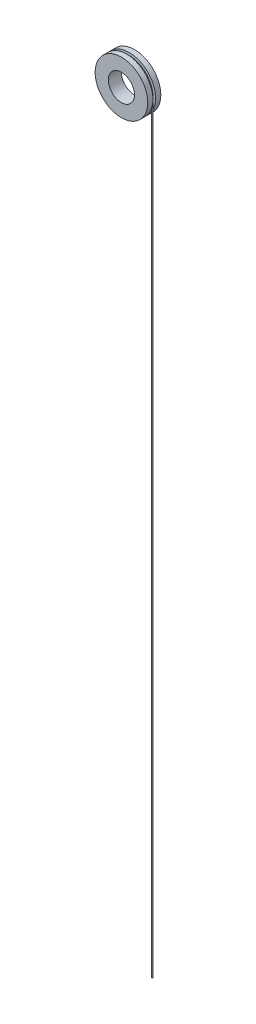
ISO-10303-21;
HEADER;
FILE_DESCRIPTION(('STEP AP214'),'2;1');
FILE_NAME('part.step','',(''),(''),'','','');
FILE_SCHEMA(('AUTOMOTIVE_DESIGN { 1 0 10303 214 1 1 1 1 }'));
ENDSEC;
DATA;
#1=APPLICATION_CONTEXT('core data for automotive mechanical design processes');
#2=APPLICATION_PROTOCOL_DEFINITION('international standard','automotive_design',2000,#1);
#3=PRODUCT_CONTEXT('',#1,'mechanical');
#4=PRODUCT('Part','Part','',(#3));
#5=PRODUCT_RELATED_PRODUCT_CATEGORY('part','',(#4));
#6=PRODUCT_DEFINITION_FORMATION('','',#4);
#7=PRODUCT_DEFINITION_CONTEXT('part definition',#1,'design');
#8=PRODUCT_DEFINITION('design','',#6,#7);
#9=PRODUCT_DEFINITION_SHAPE('','',#8);
#10=(LENGTH_UNIT() NAMED_UNIT(*) SI_UNIT(.MILLI.,.METRE.));
#11=(NAMED_UNIT(*) PLANE_ANGLE_UNIT() SI_UNIT($,.RADIAN.));
#12=(NAMED_UNIT(*) SI_UNIT($,.STERADIAN.) SOLID_ANGLE_UNIT());
#13=UNCERTAINTY_MEASURE_WITH_UNIT(LENGTH_MEASURE(1.E-05),#10,'distance_accuracy_value','');
#14=(GEOMETRIC_REPRESENTATION_CONTEXT(3) GLOBAL_UNCERTAINTY_ASSIGNED_CONTEXT((#13)) GLOBAL_UNIT_ASSIGNED_CONTEXT((#10,
#11,#12)) REPRESENTATION_CONTEXT('',''));
#15=CARTESIAN_POINT('',(0.,0.,0.));
#16=DIRECTION('',(0.,0.,1.));
#17=DIRECTION('',(1.,0.,0.));
#18=AXIS2_PLACEMENT_3D('',#15,#16,#17);
#19=CARTESIAN_POINT('',(9.25000000000002,-290.,0.));
#20=DIRECTION('',(0.,1.,0.));
#21=DIRECTION('',(-1.,0.,0.));
#22=AXIS2_PLACEMENT_3D('',#19,#20,#21);
#23=CYLINDRICAL_SURFACE('',#22,0.25);
#24=CARTESIAN_POINT('',(9.25000000000002,-290.,0.));
#25=DIRECTION('',(0.,1.,0.));
#26=DIRECTION('',(0.,0.,1.));
#27=AXIS2_PLACEMENT_3D('',#24,#25,#26);
#28=CIRCLE('',#27,0.25);
#29=CARTESIAN_POINT('',(9.25000000000002,-290.,0.25));
#30=VERTEX_POINT('',#29);
#31=EDGE_CURVE('E11',#30,#30,#28,.T.);
#32=ORIENTED_EDGE('',*,*,#31,.T.);
#33=EDGE_LOOP('',(#32));
#34=FACE_BOUND('',#33,.T.);
#35=CARTESIAN_POINT('',(9.25,0.,0.));
#36=DIRECTION('',(0.,1.,0.));
#37=DIRECTION('',(0.,0.,1.));
#38=AXIS2_PLACEMENT_3D('',#35,#36,#37);
#39=CIRCLE('',#38,0.25);
#40=CARTESIAN_POINT('',(9.25,0.,0.25));
#41=VERTEX_POINT('',#40);
#42=EDGE_CURVE('E46',#41,#41,#39,.T.);
#43=ORIENTED_EDGE('',*,*,#42,.F.);
#44=EDGE_LOOP('',(#43));
#45=FACE_BOUND('',#44,.T.);
#46=ADVANCED_FACE('F43',(#34,#45),#23,.T.);
#47=CARTESIAN_POINT('',(9.25000000000002,-290.,0.));
#48=DIRECTION('',(0.,1.,0.));
#49=DIRECTION('',(0.,0.,1.));
#50=AXIS2_PLACEMENT_3D('',#47,#48,#49);
#51=PLANE('',#50);
#52=ORIENTED_EDGE('',*,*,#31,.F.);
#53=EDGE_LOOP('',(#52));
#54=FACE_BOUND('',#53,.T.);
#55=ADVANCED_FACE('F58',(#54),#51,.F.);
#56=CARTESIAN_POINT('',(9.25,0.,0.));
#57=DIRECTION('',(0.,1.,0.));
#58=DIRECTION('',(0.,0.,1.));
#59=AXIS2_PLACEMENT_3D('',#56,#57,#58);
#60=PLANE('',#59);
#61=ORIENTED_EDGE('',*,*,#42,.T.);
#62=EDGE_LOOP('',(#61));
#63=FACE_BOUND('',#62,.T.);
#64=ADVANCED_FACE('F55',(#63),#60,.T.);
#65=CLOSED_SHELL('',(#46,#55,#64));
#66=MANIFOLD_SOLID_BREP('B2',#65);
#67=CARTESIAN_POINT('',(0.,0.,2.5));
#68=DIRECTION('',(0.,0.,-1.));
#69=DIRECTION('',(-1.,0.,0.));
#70=AXIS2_PLACEMENT_3D('',#67,#68,#69);
#71=CYLINDRICAL_SURFACE('',#70,10.);
#72=CARTESIAN_POINT('',(0.,0.,-2.5));
#73=DIRECTION('',(0.,0.,1.));
#74=DIRECTION('',(1.,0.,0.));
#75=AXIS2_PLACEMENT_3D('',#72,#73,#74);
#76=CIRCLE('',#75,10.);
#77=CARTESIAN_POINT('',(10.,0.,-2.5));
#78=VERTEX_POINT('',#77);
#79=EDGE_CURVE('E88',#78,#78,#76,.T.);
#80=ORIENTED_EDGE('',*,*,#79,.T.);
#81=EDGE_LOOP('',(#80));
#82=FACE_BOUND('',#81,.T.);
#83=CARTESIAN_POINT('',(0.,0.,-0.5));
#84=DIRECTION('',(0.,0.,1.));
#85=DIRECTION('',(1.,0.,0.));
#86=AXIS2_PLACEMENT_3D('',#83,#84,#85);
#87=CIRCLE('',#86,10.);
#88=CARTESIAN_POINT('',(10.,0.,-0.5));
#89=VERTEX_POINT('',#88);
#90=EDGE_CURVE('E111',#89,#89,#87,.T.);
#91=ORIENTED_EDGE('',*,*,#90,.F.);
#92=EDGE_LOOP('',(#91));
#93=FACE_BOUND('',#92,.T.);
#94=ADVANCED_FACE('F84',(#82,#93),#71,.T.);
#95=CARTESIAN_POINT('',(0.,0.,2.5));
#96=DIRECTION('',(0.,0.,1.));
#97=DIRECTION('',(1.,0.,0.));
#98=AXIS2_PLACEMENT_3D('',#95,#96,#97);
#99=PLANE('',#98);
#100=CARTESIAN_POINT('',(0.,0.,2.5));
#101=DIRECTION('',(0.,0.,1.));
#102=DIRECTION('',(1.,0.,0.));
#103=AXIS2_PLACEMENT_3D('',#100,#101,#102);
#104=CIRCLE('',#103,10.);
#105=CARTESIAN_POINT('',(10.,0.,2.5));
#106=VERTEX_POINT('',#105);
#107=EDGE_CURVE('E41',#106,#106,#104,.T.);
#108=ORIENTED_EDGE('',*,*,#107,.T.);
#109=EDGE_LOOP('',(#108));
#110=FACE_BOUND('',#109,.T.);
#111=CARTESIAN_POINT('',(0.,0.,2.5));
#112=DIRECTION('',(0.,0.,1.));
#113=DIRECTION('',(1.,0.,0.));
#114=AXIS2_PLACEMENT_3D('',#111,#112,#113);
#115=CIRCLE('',#114,5.);
#116=CARTESIAN_POINT('',(5.,0.,2.5));
#117=VERTEX_POINT('',#116);
#118=EDGE_CURVE('E117',#117,#117,#115,.T.);
#119=ORIENTED_EDGE('',*,*,#118,.F.);
#120=EDGE_LOOP('',(#119));
#121=FACE_BOUND('',#120,.T.);
#122=ADVANCED_FACE('F140',(#110,#121),#99,.T.);
#123=CARTESIAN_POINT('',(0.,0.,-2.5));
#124=DIRECTION('',(0.,0.,1.));
#125=DIRECTION('',(1.,0.,0.));
#126=AXIS2_PLACEMENT_3D('',#123,#124,#125);
#127=PLANE('',#126);
#128=ORIENTED_EDGE('',*,*,#79,.F.);
#129=EDGE_LOOP('',(#128));
#130=FACE_BOUND('',#129,.T.);
#131=CARTESIAN_POINT('',(0.,0.,-2.5));
#132=DIRECTION('',(0.,0.,1.));
#133=DIRECTION('',(1.,0.,0.));
#134=AXIS2_PLACEMENT_3D('',#131,#132,#133);
#135=CIRCLE('',#134,5.);
#136=CARTESIAN_POINT('',(5.,0.,-2.5));
#137=VERTEX_POINT('',#136);
#138=EDGE_CURVE('E114',#137,#137,#135,.T.);
#139=ORIENTED_EDGE('',*,*,#138,.T.);
#140=EDGE_LOOP('',(#139));
#141=FACE_BOUND('',#140,.T.);
#142=ADVANCED_FACE('F123',(#130,#141),#127,.F.);
#143=CARTESIAN_POINT('',(0.,0.,0.5));
#144=DIRECTION('',(0.,0.,1.));
#145=DIRECTION('',(1.,0.,0.));
#146=AXIS2_PLACEMENT_3D('',#143,#144,#145);
#147=CIRCLE('',#146,10.);
#148=CARTESIAN_POINT('',(10.,0.,0.5));
#149=VERTEX_POINT('',#148);
#150=EDGE_CURVE('E108',#149,#149,#147,.T.);
#151=ORIENTED_EDGE('',*,*,#150,.T.);
#152=EDGE_LOOP('',(#151));
#153=FACE_BOUND('',#152,.T.);
#154=ORIENTED_EDGE('',*,*,#107,.F.);
#155=EDGE_LOOP('',(#154));
#156=FACE_BOUND('',#155,.T.);
#157=ADVANCED_FACE('F86',(#153,#156),#71,.T.);
#158=CARTESIAN_POINT('',(0.,0.,2.5));
#159=DIRECTION('',(0.,0.,-1.));
#160=DIRECTION('',(-1.,0.,0.));
#161=AXIS2_PLACEMENT_3D('',#158,#159,#160);
#162=CYLINDRICAL_SURFACE('',#161,5.);
#163=ORIENTED_EDGE('',*,*,#118,.T.);
#164=EDGE_LOOP('',(#163));
#165=FACE_BOUND('',#164,.T.);
#166=ORIENTED_EDGE('',*,*,#138,.F.);
#167=EDGE_LOOP('',(#166));
#168=FACE_BOUND('',#167,.T.);
#169=ADVANCED_FACE('F125',(#165,#168),#162,.F.);
#170=CARTESIAN_POINT('',(0.,0.,-0.5));
#171=DIRECTION('',(0.,0.,1.));
#172=DIRECTION('',(1.,0.,0.));
#173=AXIS2_PLACEMENT_3D('',#170,#171,#172);
#174=PLANE('',#173);
#175=CARTESIAN_POINT('',(0.,0.,-0.5));
#176=DIRECTION('',(0.,0.,1.));
#177=DIRECTION('',(1.,0.,0.));
#178=AXIS2_PLACEMENT_3D('',#175,#176,#177);
#179=CIRCLE('',#178,9.);
#180=CARTESIAN_POINT('',(9.,0.,-0.5));
#181=VERTEX_POINT('',#180);
#182=EDGE_CURVE('E102',#181,#181,#179,.T.);
#183=ORIENTED_EDGE('',*,*,#182,.F.);
#184=EDGE_LOOP('',(#183));
#185=FACE_BOUND('',#184,.T.);
#186=ORIENTED_EDGE('',*,*,#90,.T.);
#187=EDGE_LOOP('',(#186));
#188=FACE_BOUND('',#187,.T.);
#189=ADVANCED_FACE('F127',(#185,#188),#174,.T.);
#190=CARTESIAN_POINT('',(0.,0.,0.5));
#191=DIRECTION('',(0.,0.,1.));
#192=DIRECTION('',(1.,0.,0.));
#193=AXIS2_PLACEMENT_3D('',#190,#191,#192);
#194=PLANE('',#193);
#195=CARTESIAN_POINT('',(0.,0.,0.5));
#196=DIRECTION('',(0.,0.,1.));
#197=DIRECTION('',(1.,0.,0.));
#198=AXIS2_PLACEMENT_3D('',#195,#196,#197);
#199=CIRCLE('',#198,9.);
#200=CARTESIAN_POINT('',(9.,0.,0.5));
#201=VERTEX_POINT('',#200);
#202=EDGE_CURVE('E105',#201,#201,#199,.T.);
#203=ORIENTED_EDGE('',*,*,#202,.T.);
#204=EDGE_LOOP('',(#203));
#205=FACE_BOUND('',#204,.T.);
#206=ORIENTED_EDGE('',*,*,#150,.F.);
#207=EDGE_LOOP('',(#206));
#208=FACE_BOUND('',#207,.T.);
#209=ADVANCED_FACE('F97',(#205,#208),#194,.F.);
#210=CARTESIAN_POINT('',(0.,0.,-0.5));
#211=DIRECTION('',(0.,0.,1.));
#212=DIRECTION('',(1.,0.,0.));
#213=AXIS2_PLACEMENT_3D('',#210,#211,#212);
#214=CYLINDRICAL_SURFACE('',#213,9.);
#215=CARTESIAN_POINT('',(9.,0.,0.));
#216=VERTEX_POINT('',#215);
#217=VERTEX_LOOP('',#216);
#218=FACE_BOUND('',#217,.T.);
#219=ORIENTED_EDGE('',*,*,#182,.T.);
#220=EDGE_LOOP('',(#219));
#221=FACE_BOUND('',#220,.T.);
#222=ORIENTED_EDGE('',*,*,#202,.F.);
#223=EDGE_LOOP('',(#222));
#224=FACE_BOUND('',#223,.T.);
#225=ADVANCED_FACE('F94',(#218,#221,#224),#214,.T.);
#226=CLOSED_SHELL('',(#94,#122,#142,#157,#169,#189,#209,#225));
#227=MANIFOLD_SOLID_BREP('B6',#226);
#228=ADVANCED_BREP_SHAPE_REPRESENTATION('',(#18,#66,#227),#14);
#229=SHAPE_DEFINITION_REPRESENTATION(#9,#228);
ENDSEC;
END-ISO-10303-21;
